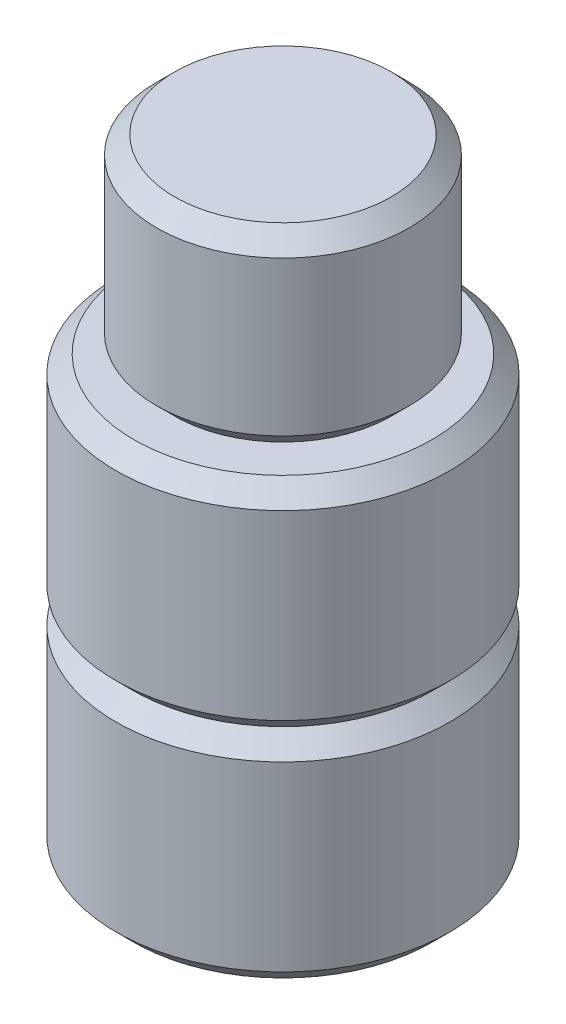
ISO-10303-21;
HEADER;
FILE_DESCRIPTION(('STEP AP214'),'2;1');
FILE_NAME('part.step','',(''),(''),'','','');
FILE_SCHEMA(('AUTOMOTIVE_DESIGN { 1 0 10303 214 1 1 1 1 }'));
ENDSEC;
DATA;
#1=APPLICATION_CONTEXT('core data for automotive mechanical design processes');
#2=APPLICATION_PROTOCOL_DEFINITION('international standard','automotive_design',2000,#1);
#3=PRODUCT_CONTEXT('',#1,'mechanical');
#4=PRODUCT('Part','Part','',(#3));
#5=PRODUCT_RELATED_PRODUCT_CATEGORY('part','',(#4));
#6=PRODUCT_DEFINITION_FORMATION('','',#4);
#7=PRODUCT_DEFINITION_CONTEXT('part definition',#1,'design');
#8=PRODUCT_DEFINITION('design','',#6,#7);
#9=PRODUCT_DEFINITION_SHAPE('','',#8);
#10=(LENGTH_UNIT() NAMED_UNIT(*) SI_UNIT(.MILLI.,.METRE.));
#11=(NAMED_UNIT(*) PLANE_ANGLE_UNIT() SI_UNIT($,.RADIAN.));
#12=(NAMED_UNIT(*) SI_UNIT($,.STERADIAN.) SOLID_ANGLE_UNIT());
#13=UNCERTAINTY_MEASURE_WITH_UNIT(LENGTH_MEASURE(1.E-05),#10,'distance_accuracy_value','');
#14=(GEOMETRIC_REPRESENTATION_CONTEXT(3) GLOBAL_UNCERTAINTY_ASSIGNED_CONTEXT((#13)) GLOBAL_UNIT_ASSIGNED_CONTEXT((#10,
#11,#12)) REPRESENTATION_CONTEXT('',''));
#15=CARTESIAN_POINT('',(0.,0.,0.));
#16=DIRECTION('',(0.,0.,1.));
#17=DIRECTION('',(1.,0.,0.));
#18=AXIS2_PLACEMENT_3D('',#15,#16,#17);
#19=CARTESIAN_POINT('',(0.,0.,0.));
#20=DIRECTION('',(0.,-1.,0.));
#21=DIRECTION('',(0.,0.,-1.));
#22=AXIS2_PLACEMENT_3D('',#19,#20,#21);
#23=PLANE('',#22);
#24=CARTESIAN_POINT('',(0.,0.,0.));
#25=DIRECTION('',(0.,-1.,0.));
#26=DIRECTION('',(0.,0.,-1.));
#27=AXIS2_PLACEMENT_3D('',#24,#25,#26);
#28=CIRCLE('',#27,16.65);
#29=CARTESIAN_POINT('',(0.,0.,-16.65));
#30=VERTEX_POINT('',#29);
#31=EDGE_CURVE('E10',#30,#30,#28,.T.);
#32=ORIENTED_EDGE('',*,*,#31,.T.);
#33=EDGE_LOOP('',(#32));
#34=FACE_BOUND('',#33,.T.);
#35=ADVANCED_FACE('F31',(#34),#23,.T.);
#36=CARTESIAN_POINT('',(0.,0.,0.));
#37=DIRECTION('',(0.,1.,0.));
#38=DIRECTION('',(0.,0.,1.));
#39=AXIS2_PLACEMENT_3D('',#36,#37,#38);
#40=CONICAL_SURFACE('',#39,16.65,0.785398163397448);
#41=CARTESIAN_POINT('',(0.,2.,0.));
#42=DIRECTION('',(0.,-1.,0.));
#43=DIRECTION('',(0.,0.,-1.));
#44=AXIS2_PLACEMENT_3D('',#41,#42,#43);
#45=CIRCLE('',#44,18.65);
#46=CARTESIAN_POINT('',(0.,2.,-18.65));
#47=VERTEX_POINT('',#46);
#48=EDGE_CURVE('E37',#47,#47,#45,.T.);
#49=ORIENTED_EDGE('',*,*,#48,.T.);
#50=EDGE_LOOP('',(#49));
#51=FACE_BOUND('',#50,.T.);
#52=ORIENTED_EDGE('',*,*,#31,.F.);
#53=EDGE_LOOP('',(#52));
#54=FACE_BOUND('',#53,.T.);
#55=ADVANCED_FACE('F84',(#51,#54),#40,.T.);
#56=CARTESIAN_POINT('',(0.,0.,0.));
#57=DIRECTION('',(0.,-1.,0.));
#58=DIRECTION('',(0.,0.,-1.));
#59=AXIS2_PLACEMENT_3D('',#56,#57,#58);
#60=CYLINDRICAL_SURFACE('',#59,18.65);
#61=CARTESIAN_POINT('',(0.,22.31,0.));
#62=DIRECTION('',(0.,-1.,0.));
#63=DIRECTION('',(0.,0.,-1.));
#64=AXIS2_PLACEMENT_3D('',#61,#62,#63);
#65=CIRCLE('',#64,18.65);
#66=CARTESIAN_POINT('',(0.,22.31,-18.65));
#67=VERTEX_POINT('',#66);
#68=EDGE_CURVE('E41',#67,#67,#65,.T.);
#69=ORIENTED_EDGE('',*,*,#68,.T.);
#70=EDGE_LOOP('',(#69));
#71=FACE_BOUND('',#70,.T.);
#72=ORIENTED_EDGE('',*,*,#48,.F.);
#73=EDGE_LOOP('',(#72));
#74=FACE_BOUND('',#73,.T.);
#75=ADVANCED_FACE('F88',(#71,#74),#60,.T.);
#76=CARTESIAN_POINT('',(0.,22.31,0.));
#77=DIRECTION('',(0.,-1.,0.));
#78=DIRECTION('',(0.,0.,-1.));
#79=AXIS2_PLACEMENT_3D('',#76,#77,#78);
#80=CONICAL_SURFACE('',#79,18.65,0.785398163397448);
#81=CARTESIAN_POINT('',(0.,24.31,0.));
#82=DIRECTION('',(0.,-1.,0.));
#83=DIRECTION('',(0.,0.,-1.));
#84=AXIS2_PLACEMENT_3D('',#81,#82,#83);
#85=CIRCLE('',#84,16.65);
#86=CARTESIAN_POINT('',(0.,24.31,-16.65));
#87=VERTEX_POINT('',#86);
#88=EDGE_CURVE('E45',#87,#87,#85,.T.);
#89=ORIENTED_EDGE('',*,*,#88,.T.);
#90=EDGE_LOOP('',(#89));
#91=FACE_BOUND('',#90,.T.);
#92=ORIENTED_EDGE('',*,*,#68,.F.);
#93=EDGE_LOOP('',(#92));
#94=FACE_BOUND('',#93,.T.);
#95=ADVANCED_FACE('F92',(#91,#94),#80,.T.);
#96=CARTESIAN_POINT('',(0.,24.31,0.));
#97=DIRECTION('',(0.,1.,0.));
#98=DIRECTION('',(0.,0.,1.));
#99=AXIS2_PLACEMENT_3D('',#96,#97,#98);
#100=CONICAL_SURFACE('',#99,16.65,0.78539816339745);
#101=CARTESIAN_POINT('',(0.,26.31,0.));
#102=DIRECTION('',(0.,-1.,0.));
#103=DIRECTION('',(0.,0.,-1.));
#104=AXIS2_PLACEMENT_3D('',#101,#102,#103);
#105=CIRCLE('',#104,18.65);
#106=CARTESIAN_POINT('',(0.,26.31,-18.65));
#107=VERTEX_POINT('',#106);
#108=EDGE_CURVE('E50',#107,#107,#105,.T.);
#109=ORIENTED_EDGE('',*,*,#108,.T.);
#110=EDGE_LOOP('',(#109));
#111=FACE_BOUND('',#110,.T.);
#112=ORIENTED_EDGE('',*,*,#88,.F.);
#113=EDGE_LOOP('',(#112));
#114=FACE_BOUND('',#113,.T.);
#115=ADVANCED_FACE('F99',(#111,#114),#100,.T.);
#116=CARTESIAN_POINT('',(0.,0.,0.));
#117=DIRECTION('',(0.,-1.,0.));
#118=DIRECTION('',(0.,0.,-1.));
#119=AXIS2_PLACEMENT_3D('',#116,#117,#118);
#120=CYLINDRICAL_SURFACE('',#119,18.65);
#121=CARTESIAN_POINT('',(0.,46.6199999999999,0.));
#122=DIRECTION('',(0.,-1.,0.));
#123=DIRECTION('',(0.,0.,-1.));
#124=AXIS2_PLACEMENT_3D('',#121,#122,#123);
#125=CIRCLE('',#124,18.65);
#126=CARTESIAN_POINT('',(0.,46.6199999999999,-18.65));
#127=VERTEX_POINT('',#126);
#128=EDGE_CURVE('E53',#127,#127,#125,.T.);
#129=ORIENTED_EDGE('',*,*,#128,.T.);
#130=EDGE_LOOP('',(#129));
#131=FACE_BOUND('',#130,.T.);
#132=ORIENTED_EDGE('',*,*,#108,.F.);
#133=EDGE_LOOP('',(#132));
#134=FACE_BOUND('',#133,.T.);
#135=ADVANCED_FACE('F103',(#131,#134),#120,.T.);
#136=CARTESIAN_POINT('',(0.,46.6199999999999,0.));
#137=DIRECTION('',(0.,-1.,0.));
#138=DIRECTION('',(0.,0.,-1.));
#139=AXIS2_PLACEMENT_3D('',#136,#137,#138);
#140=CONICAL_SURFACE('',#139,18.65,0.785398163397448);
#141=CARTESIAN_POINT('',(0.,48.6199999999999,0.));
#142=DIRECTION('',(0.,-1.,0.));
#143=DIRECTION('',(0.,0.,-1.));
#144=AXIS2_PLACEMENT_3D('',#141,#142,#143);
#145=CIRCLE('',#144,16.65);
#146=CARTESIAN_POINT('',(0.,48.6199999999999,-16.65));
#147=VERTEX_POINT('',#146);
#148=EDGE_CURVE('E56',#147,#147,#145,.T.);
#149=ORIENTED_EDGE('',*,*,#148,.T.);
#150=EDGE_LOOP('',(#149));
#151=FACE_BOUND('',#150,.T.);
#152=ORIENTED_EDGE('',*,*,#128,.F.);
#153=EDGE_LOOP('',(#152));
#154=FACE_BOUND('',#153,.T.);
#155=ADVANCED_FACE('F107',(#151,#154),#140,.T.);
#156=CARTESIAN_POINT('',(16.65,48.62,0.));
#157=DIRECTION('',(0.,1.,0.));
#158=DIRECTION('',(0.,0.,1.));
#159=AXIS2_PLACEMENT_3D('',#156,#157,#158);
#160=PLANE('',#159);
#161=CARTESIAN_POINT('',(0.,48.62,0.));
#162=DIRECTION('',(0.,-1.,0.));
#163=DIRECTION('',(0.,0.,-1.));
#164=AXIS2_PLACEMENT_3D('',#161,#162,#163);
#165=CIRCLE('',#164,12.1);
#166=CARTESIAN_POINT('',(0.,48.62,-12.1));
#167=VERTEX_POINT('',#166);
#168=EDGE_CURVE('E59',#167,#167,#165,.T.);
#169=ORIENTED_EDGE('',*,*,#168,.T.);
#170=EDGE_LOOP('',(#169));
#171=FACE_BOUND('',#170,.T.);
#172=ORIENTED_EDGE('',*,*,#148,.F.);
#173=EDGE_LOOP('',(#172));
#174=FACE_BOUND('',#173,.T.);
#175=ADVANCED_FACE('F111',(#171,#174),#160,.T.);
#176=CARTESIAN_POINT('',(0.,48.62,0.));
#177=DIRECTION('',(0.,1.,0.));
#178=DIRECTION('',(0.,0.,1.));
#179=AXIS2_PLACEMENT_3D('',#176,#177,#178);
#180=CONICAL_SURFACE('',#179,12.1,0.785398163397451);
#181=CARTESIAN_POINT('',(0.,50.6199999999999,0.));
#182=DIRECTION('',(0.,-1.,0.));
#183=DIRECTION('',(0.,0.,-1.));
#184=AXIS2_PLACEMENT_3D('',#181,#182,#183);
#185=CIRCLE('',#184,14.1);
#186=CARTESIAN_POINT('',(0.,50.6199999999999,-14.1));
#187=VERTEX_POINT('',#186);
#188=EDGE_CURVE('E62',#187,#187,#185,.T.);
#189=ORIENTED_EDGE('',*,*,#188,.T.);
#190=EDGE_LOOP('',(#189));
#191=FACE_BOUND('',#190,.T.);
#192=ORIENTED_EDGE('',*,*,#168,.F.);
#193=EDGE_LOOP('',(#192));
#194=FACE_BOUND('',#193,.T.);
#195=ADVANCED_FACE('F115',(#191,#194),#180,.T.);
#196=CARTESIAN_POINT('',(0.,0.,0.));
#197=DIRECTION('',(0.,-1.,0.));
#198=DIRECTION('',(0.,0.,-1.));
#199=AXIS2_PLACEMENT_3D('',#196,#197,#198);
#200=CYLINDRICAL_SURFACE('',#199,14.1);
#201=CARTESIAN_POINT('',(0.,67.8299999999999,0.));
#202=DIRECTION('',(0.,-1.,0.));
#203=DIRECTION('',(0.,0.,-1.));
#204=AXIS2_PLACEMENT_3D('',#201,#202,#203);
#205=CIRCLE('',#204,14.1);
#206=CARTESIAN_POINT('',(0.,67.8299999999999,-14.1));
#207=VERTEX_POINT('',#206);
#208=EDGE_CURVE('E65',#207,#207,#205,.T.);
#209=ORIENTED_EDGE('',*,*,#208,.T.);
#210=EDGE_LOOP('',(#209));
#211=FACE_BOUND('',#210,.T.);
#212=ORIENTED_EDGE('',*,*,#188,.F.);
#213=EDGE_LOOP('',(#212));
#214=FACE_BOUND('',#213,.T.);
#215=ADVANCED_FACE('F81',(#211,#214),#200,.T.);
#216=CARTESIAN_POINT('',(0.,67.8299999999999,0.));
#217=DIRECTION('',(0.,-1.,0.));
#218=DIRECTION('',(0.,0.,-1.));
#219=AXIS2_PLACEMENT_3D('',#216,#217,#218);
#220=CONICAL_SURFACE('',#219,14.1,0.785398163397444);
#221=CARTESIAN_POINT('',(0.,69.83,0.));
#222=DIRECTION('',(0.,-1.,0.));
#223=DIRECTION('',(0.,0.,-1.));
#224=AXIS2_PLACEMENT_3D('',#221,#222,#223);
#225=CIRCLE('',#224,12.1);
#226=CARTESIAN_POINT('',(0.,69.83,-12.1));
#227=VERTEX_POINT('',#226);
#228=EDGE_CURVE('E68',#227,#227,#225,.T.);
#229=ORIENTED_EDGE('',*,*,#228,.T.);
#230=EDGE_LOOP('',(#229));
#231=FACE_BOUND('',#230,.T.);
#232=ORIENTED_EDGE('',*,*,#208,.F.);
#233=EDGE_LOOP('',(#232));
#234=FACE_BOUND('',#233,.T.);
#235=ADVANCED_FACE('F72',(#231,#234),#220,.T.);
#236=CARTESIAN_POINT('',(12.1,69.83,0.));
#237=DIRECTION('',(0.,1.,0.));
#238=DIRECTION('',(0.,0.,1.));
#239=AXIS2_PLACEMENT_3D('',#236,#237,#238);
#240=PLANE('',#239);
#241=ORIENTED_EDGE('',*,*,#228,.F.);
#242=EDGE_LOOP('',(#241));
#243=FACE_BOUND('',#242,.T.);
#244=ADVANCED_FACE('F75',(#243),#240,.T.);
#245=CLOSED_SHELL('',(#35,#55,#75,#95,#115,#135,#155,#175,#195,#215,#235,#244));
#246=MANIFOLD_SOLID_BREP('B2',#245);
#247=ADVANCED_BREP_SHAPE_REPRESENTATION('',(#18,#246),#14);
#248=SHAPE_DEFINITION_REPRESENTATION(#9,#247);
ENDSEC;
END-ISO-10303-21;
